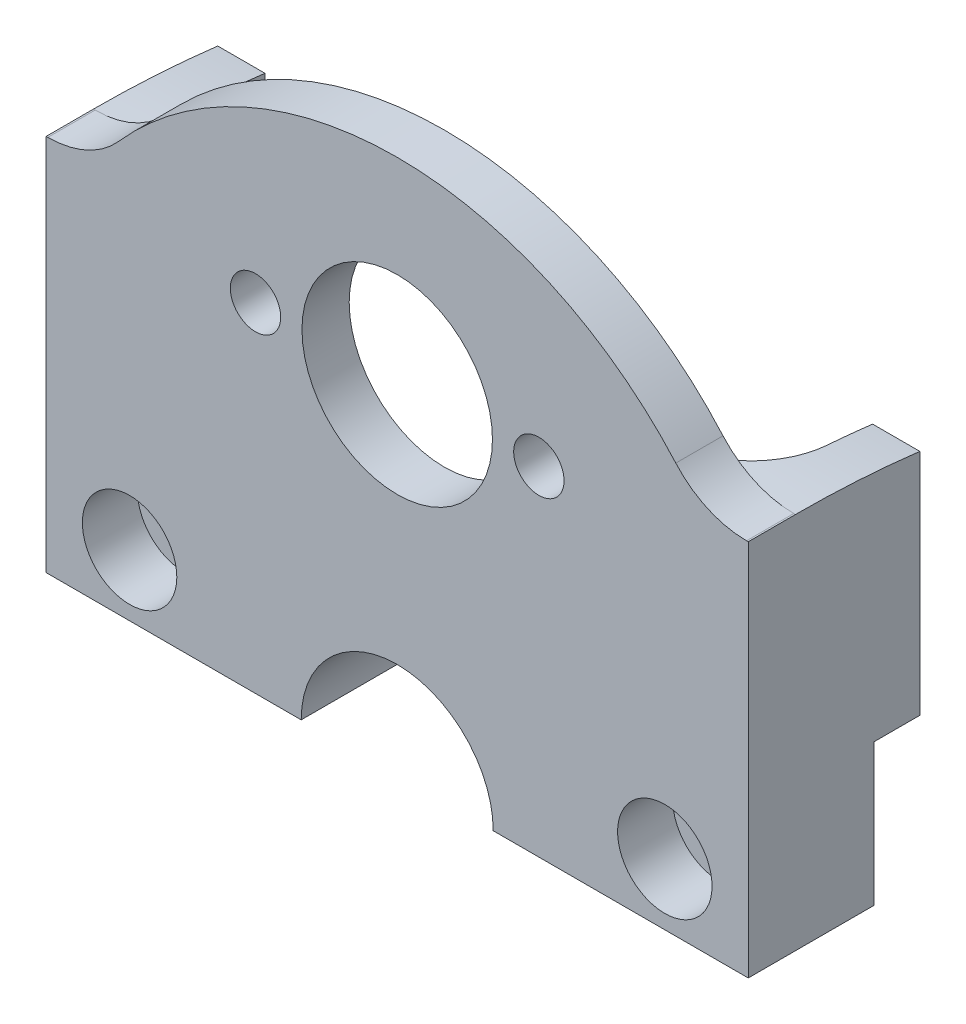
ISO-10303-21;
HEADER;
FILE_DESCRIPTION(('STEP AP214'),'2;1');
FILE_NAME('part.step','',(''),(''),'','','');
FILE_SCHEMA(('AUTOMOTIVE_DESIGN { 1 0 10303 214 1 1 1 1 }'));
ENDSEC;
DATA;
#1=APPLICATION_CONTEXT('core data for automotive mechanical design processes');
#2=APPLICATION_PROTOCOL_DEFINITION('international standard','automotive_design',2000,#1);
#3=PRODUCT_CONTEXT('',#1,'mechanical');
#4=PRODUCT('Part','Part','',(#3));
#5=PRODUCT_RELATED_PRODUCT_CATEGORY('part','',(#4));
#6=PRODUCT_DEFINITION_FORMATION('','',#4);
#7=PRODUCT_DEFINITION_CONTEXT('part definition',#1,'design');
#8=PRODUCT_DEFINITION('design','',#6,#7);
#9=PRODUCT_DEFINITION_SHAPE('','',#8);
#10=(LENGTH_UNIT() NAMED_UNIT(*) SI_UNIT(.MILLI.,.METRE.));
#11=(NAMED_UNIT(*) PLANE_ANGLE_UNIT() SI_UNIT($,.RADIAN.));
#12=(NAMED_UNIT(*) SI_UNIT($,.STERADIAN.) SOLID_ANGLE_UNIT());
#13=UNCERTAINTY_MEASURE_WITH_UNIT(LENGTH_MEASURE(1.E-05),#10,'distance_accuracy_value','');
#14=(GEOMETRIC_REPRESENTATION_CONTEXT(3) GLOBAL_UNCERTAINTY_ASSIGNED_CONTEXT((#13)) GLOBAL_UNIT_ASSIGNED_CONTEXT((#10,
#11,#12)) REPRESENTATION_CONTEXT('',''));
#15=CARTESIAN_POINT('',(0.,0.,0.));
#16=DIRECTION('',(0.,0.,1.));
#17=DIRECTION('',(1.,0.,0.));
#18=AXIS2_PLACEMENT_3D('',#15,#16,#17);
#19=CARTESIAN_POINT('',(-17.,18.8,-8.));
#20=DIRECTION('',(0.,0.,1.));
#21=DIRECTION('',(1.,0.,0.));
#22=AXIS2_PLACEMENT_3D('',#19,#20,#21);
#23=CYLINDRICAL_SURFACE('',#22,1.6);
#24=CARTESIAN_POINT('',(-17.,18.8,-8.));
#25=DIRECTION('',(0.,0.,1.));
#26=DIRECTION('',(1.,0.,0.));
#27=AXIS2_PLACEMENT_3D('',#24,#25,#26);
#28=CIRCLE('',#27,1.6);
#29=CARTESIAN_POINT('',(-15.4,18.8,-8.));
#30=VERTEX_POINT('',#29);
#31=EDGE_CURVE('E224',#30,#30,#28,.T.);
#32=ORIENTED_EDGE('',*,*,#31,.F.);
#33=EDGE_LOOP('',(#32));
#34=FACE_BOUND('',#33,.T.);
#35=CARTESIAN_POINT('',(-17.,18.8,-3.5));
#36=DIRECTION('',(0.,0.,1.));
#37=DIRECTION('',(1.,0.,0.));
#38=AXIS2_PLACEMENT_3D('',#35,#36,#37);
#39=CIRCLE('',#38,1.6);
#40=CARTESIAN_POINT('',(-15.4,18.8,-3.5));
#41=VERTEX_POINT('',#40);
#42=EDGE_CURVE('E199',#41,#41,#39,.F.);
#43=ORIENTED_EDGE('',*,*,#42,.F.);
#44=EDGE_LOOP('',(#43));
#45=FACE_BOUND('',#44,.T.);
#46=ADVANCED_FACE('F34',(#34,#45),#23,.F.);
#47=CARTESIAN_POINT('',(17.,18.8,-8.));
#48=DIRECTION('',(0.,0.,1.));
#49=DIRECTION('',(1.,0.,0.));
#50=AXIS2_PLACEMENT_3D('',#47,#48,#49);
#51=CYLINDRICAL_SURFACE('',#50,1.6);
#52=CARTESIAN_POINT('',(17.,18.8,-8.));
#53=DIRECTION('',(0.,0.,1.));
#54=DIRECTION('',(1.,0.,0.));
#55=AXIS2_PLACEMENT_3D('',#52,#53,#54);
#56=CIRCLE('',#55,1.6);
#57=CARTESIAN_POINT('',(18.6,18.8,-8.));
#58=VERTEX_POINT('',#57);
#59=EDGE_CURVE('E221',#58,#58,#56,.T.);
#60=ORIENTED_EDGE('',*,*,#59,.F.);
#61=EDGE_LOOP('',(#60));
#62=FACE_BOUND('',#61,.T.);
#63=CARTESIAN_POINT('',(17.,18.8,-3.5));
#64=DIRECTION('',(0.,0.,1.));
#65=DIRECTION('',(1.,0.,0.));
#66=AXIS2_PLACEMENT_3D('',#63,#64,#65);
#67=CIRCLE('',#66,1.6);
#68=CARTESIAN_POINT('',(18.6,18.8,-3.5));
#69=VERTEX_POINT('',#68);
#70=EDGE_CURVE('E203',#69,#69,#67,.F.);
#71=ORIENTED_EDGE('',*,*,#70,.F.);
#72=EDGE_LOOP('',(#71));
#73=FACE_BOUND('',#72,.T.);
#74=ADVANCED_FACE('F370',(#62,#73),#51,.F.);
#75=CARTESIAN_POINT('',(0.,25.2755,-3.));
#76=DIRECTION('',(0.,0.,1.));
#77=DIRECTION('',(1.,0.,0.));
#78=AXIS2_PLACEMENT_3D('',#75,#76,#77);
#79=CYLINDRICAL_SURFACE('',#78,23.6245);
#80=CARTESIAN_POINT('',(0.,25.2755,0.));
#81=DIRECTION('',(0.,0.,1.));
#82=DIRECTION('',(1.,0.,0.));
#83=AXIS2_PLACEMENT_3D('',#80,#81,#82);
#84=CIRCLE('',#83,23.6245);
#85=CARTESIAN_POINT('',(-17.6974341426189,40.9253506388293,0.));
#86=VERTEX_POINT('',#85);
#87=CARTESIAN_POINT('',(17.6974341426189,40.9253506388293,0.));
#88=VERTEX_POINT('',#87);
#89=EDGE_CURVE('E253',#86,#88,#84,.F.);
#90=ORIENTED_EDGE('',*,*,#89,.T.);
#91=DIRECTION('',(0.,0.,1.));
#92=VECTOR('',#91,1.);
#93=CARTESIAN_POINT('',(17.6974341426189,40.9253506388293,-3.));
#94=LINE('',#93,#92);
#95=CARTESIAN_POINT('',(17.6974341426189,40.9253506388293,-3.));
#96=VERTEX_POINT('',#95);
#97=EDGE_CURVE('E314',#88,#96,#94,.F.);
#98=ORIENTED_EDGE('',*,*,#97,.T.);
#99=CARTESIAN_POINT('',(0.,25.2755,-3.));
#100=DIRECTION('',(0.,0.,1.));
#101=DIRECTION('',(1.,0.,0.));
#102=AXIS2_PLACEMENT_3D('',#99,#100,#101);
#103=CIRCLE('',#102,23.6245);
#104=CARTESIAN_POINT('',(-17.6974341426189,40.9253506388293,-3.));
#105=VERTEX_POINT('',#104);
#106=EDGE_CURVE('E260',#105,#96,#103,.F.);
#107=ORIENTED_EDGE('',*,*,#106,.F.);
#108=DIRECTION('',(0.,0.,1.));
#109=VECTOR('',#108,1.);
#110=CARTESIAN_POINT('',(-17.6974341426189,40.9253506388293,-3.));
#111=LINE('',#110,#109);
#112=EDGE_CURVE('E311',#105,#86,#111,.T.);
#113=ORIENTED_EDGE('',*,*,#112,.T.);
#114=EDGE_LOOP('',(#90,#98,#107,#113));
#115=FACE_BOUND('',#114,.T.);
#116=ADVANCED_FACE('F366',(#115),#79,.T.);
#117=CARTESIAN_POINT('',(0.,38.9,-3.));
#118=DIRECTION('',(0.,-1.,0.));
#119=DIRECTION('',(0.,0.,-1.));
#120=AXIS2_PLACEMENT_3D('',#117,#118,#119);
#121=PLANE('',#120);
#122=DIRECTION('',(1.,0.,0.));
#123=VECTOR('',#122,1.);
#124=CARTESIAN_POINT('',(0.,38.9,-3.));
#125=LINE('',#124,#123);
#126=CARTESIAN_POINT('',(22.1921157170739,38.9,-3.));
#127=VERTEX_POINT('',#126);
#128=CARTESIAN_POINT('',(22.3,38.9,-3.));
#129=VERTEX_POINT('',#128);
#130=EDGE_CURVE('E270',#127,#129,#125,.T.);
#131=ORIENTED_EDGE('',*,*,#130,.F.);
#132=DIRECTION('',(0.,0.,-1.));
#133=VECTOR('',#132,1.);
#134=CARTESIAN_POINT('',(22.1921157170739,38.9,0.));
#135=LINE('',#134,#133);
#136=CARTESIAN_POINT('',(22.1921157170739,38.9,0.));
#137=VERTEX_POINT('',#136);
#138=EDGE_CURVE('E304',#127,#137,#135,.F.);
#139=ORIENTED_EDGE('',*,*,#138,.T.);
#140=DIRECTION('',(1.,0.,0.));
#141=VECTOR('',#140,1.);
#142=CARTESIAN_POINT('',(0.,38.9,0.));
#143=LINE('',#142,#141);
#144=CARTESIAN_POINT('',(22.3,38.9,0.));
#145=VERTEX_POINT('',#144);
#146=EDGE_CURVE('E291',#137,#145,#143,.T.);
#147=ORIENTED_EDGE('',*,*,#146,.T.);
#148=DIRECTION('',(0.,0.,1.));
#149=VECTOR('',#148,1.);
#150=CARTESIAN_POINT('',(22.3,38.9,-3.));
#151=LINE('',#150,#149);
#152=EDGE_CURVE('E301',#129,#145,#151,.T.);
#153=ORIENTED_EDGE('',*,*,#152,.F.);
#154=EDGE_LOOP('',(#131,#139,#147,#153));
#155=FACE_BOUND('',#154,.T.);
#156=ADVANCED_FACE('F369',(#155),#121,.F.);
#157=CARTESIAN_POINT('',(22.3,0.,-3.));
#158=DIRECTION('',(-1.,0.,0.));
#159=DIRECTION('',(0.,-1.,0.));
#160=AXIS2_PLACEMENT_3D('',#157,#158,#159);
#161=PLANE('',#160);
#162=DIRECTION('',(0.,0.,1.));
#163=VECTOR('',#162,1.);
#164=CARTESIAN_POINT('',(22.3,23.9,-8.));
#165=LINE('',#164,#163);
#166=CARTESIAN_POINT('',(22.3,23.9,-10.9));
#167=VERTEX_POINT('',#166);
#168=CARTESIAN_POINT('',(22.3,23.9,-8.));
#169=VERTEX_POINT('',#168);
#170=EDGE_CURVE('E187',#167,#169,#165,.T.);
#171=ORIENTED_EDGE('',*,*,#170,.F.);
#172=DIRECTION('',(0.,1.,0.));
#173=VECTOR('',#172,1.);
#174=CARTESIAN_POINT('',(22.3,67.2029660910765,-10.9));
#175=LINE('',#174,#173);
#176=CARTESIAN_POINT('',(22.3,38.4219895869804,-10.9));
#177=VERTEX_POINT('',#176);
#178=EDGE_CURVE('E169',#167,#177,#175,.T.);
#179=ORIENTED_EDGE('',*,*,#178,.T.);
#180=CARTESIAN_POINT('',(22.3,-26.6200098668084,-3.));
#181=DIRECTION('',(-1.,0.,0.));
#182=DIRECTION('',(0.,1.,0.));
#183=AXIS2_PLACEMENT_3D('',#180,#181,#182);
#184=CIRCLE('',#183,65.5200098668084);
#185=EDGE_CURVE('E198',#129,#177,#184,.T.);
#186=ORIENTED_EDGE('',*,*,#185,.F.);
#187=ORIENTED_EDGE('',*,*,#152,.T.);
#188=DIRECTION('',(0.,-1.,0.));
#189=VECTOR('',#188,1.);
#190=CARTESIAN_POINT('',(22.3,0.,0.));
#191=LINE('',#190,#189);
#192=CARTESIAN_POINT('',(22.3,14.9,0.));
#193=VERTEX_POINT('',#192);
#194=EDGE_CURVE('E289',#145,#193,#191,.T.);
#195=ORIENTED_EDGE('',*,*,#194,.T.);
#196=DIRECTION('',(0.,0.,1.));
#197=VECTOR('',#196,1.);
#198=CARTESIAN_POINT('',(22.3,14.9,-8.));
#199=LINE('',#198,#197);
#200=CARTESIAN_POINT('',(22.3,14.9,-8.));
#201=VERTEX_POINT('',#200);
#202=EDGE_CURVE('E254',#201,#193,#199,.T.);
#203=ORIENTED_EDGE('',*,*,#202,.F.);
#204=DIRECTION('',(0.,1.,0.));
#205=VECTOR('',#204,1.);
#206=CARTESIAN_POINT('',(22.3,0.,-8.));
#207=LINE('',#206,#205);
#208=EDGE_CURVE('E197',#201,#169,#207,.T.);
#209=ORIENTED_EDGE('',*,*,#208,.T.);
#210=EDGE_LOOP('',(#171,#179,#186,#187,#195,#203,#209));
#211=FACE_BOUND('',#210,.T.);
#212=ADVANCED_FACE('F195',(#211),#161,.F.);
#213=CARTESIAN_POINT('',(-22.3,0.,-3.));
#214=DIRECTION('',(-1.,0.,0.));
#215=DIRECTION('',(0.,-1.,0.));
#216=AXIS2_PLACEMENT_3D('',#213,#214,#215);
#217=PLANE('',#216);
#218=DIRECTION('',(0.,1.,0.));
#219=VECTOR('',#218,1.);
#220=CARTESIAN_POINT('',(-22.3,67.2029660910765,-10.9));
#221=LINE('',#220,#219);
#222=CARTESIAN_POINT('',(-22.3,23.9,-10.9));
#223=VERTEX_POINT('',#222);
#224=CARTESIAN_POINT('',(-22.3,38.4219895869804,-10.9));
#225=VERTEX_POINT('',#224);
#226=EDGE_CURVE('E181',#223,#225,#221,.T.);
#227=ORIENTED_EDGE('',*,*,#226,.F.);
#228=DIRECTION('',(0.,0.,1.));
#229=VECTOR('',#228,1.);
#230=CARTESIAN_POINT('',(-22.3,23.9,-8.));
#231=LINE('',#230,#229);
#232=CARTESIAN_POINT('',(-22.3,23.9,-8.));
#233=VERTEX_POINT('',#232);
#234=EDGE_CURVE('E212',#223,#233,#231,.T.);
#235=ORIENTED_EDGE('',*,*,#234,.T.);
#236=DIRECTION('',(0.,-1.,0.));
#237=VECTOR('',#236,1.);
#238=CARTESIAN_POINT('',(-22.3,0.,-8.));
#239=LINE('',#238,#237);
#240=CARTESIAN_POINT('',(-22.3,14.9,-8.));
#241=VERTEX_POINT('',#240);
#242=EDGE_CURVE('E240',#233,#241,#239,.T.);
#243=ORIENTED_EDGE('',*,*,#242,.T.);
#244=DIRECTION('',(0.,0.,1.));
#245=VECTOR('',#244,1.);
#246=CARTESIAN_POINT('',(-22.3,14.9,-8.));
#247=LINE('',#246,#245);
#248=CARTESIAN_POINT('',(-22.3,14.9,0.));
#249=VERTEX_POINT('',#248);
#250=EDGE_CURVE('E250',#241,#249,#247,.T.);
#251=ORIENTED_EDGE('',*,*,#250,.T.);
#252=DIRECTION('',(0.,-1.,0.));
#253=VECTOR('',#252,1.);
#254=CARTESIAN_POINT('',(-22.3,0.,0.));
#255=LINE('',#254,#253);
#256=CARTESIAN_POINT('',(-22.3,38.9,0.));
#257=VERTEX_POINT('',#256);
#258=EDGE_CURVE('E287',#257,#249,#255,.T.);
#259=ORIENTED_EDGE('',*,*,#258,.F.);
#260=DIRECTION('',(0.,0.,1.));
#261=VECTOR('',#260,1.);
#262=CARTESIAN_POINT('',(-22.3,38.9,-3.));
#263=LINE('',#262,#261);
#264=CARTESIAN_POINT('',(-22.3,38.9,-3.));
#265=VERTEX_POINT('',#264);
#266=EDGE_CURVE('E281',#265,#257,#263,.T.);
#267=ORIENTED_EDGE('',*,*,#266,.F.);
#268=CARTESIAN_POINT('',(-22.3,-26.6200098668084,-3.));
#269=DIRECTION('',(-1.,0.,0.));
#270=DIRECTION('',(0.,1.,0.));
#271=AXIS2_PLACEMENT_3D('',#268,#269,#270);
#272=CIRCLE('',#271,65.5200098668084);
#273=EDGE_CURVE('E191',#265,#225,#272,.T.);
#274=ORIENTED_EDGE('',*,*,#273,.T.);
#275=EDGE_LOOP('',(#227,#235,#243,#251,#259,#267,#274));
#276=FACE_BOUND('',#275,.T.);
#277=ADVANCED_FACE('F378',(#276),#217,.T.);
#278=CARTESIAN_POINT('',(-8.99999999999999,36.4,-3.));
#279=DIRECTION('',(0.,0.,1.));
#280=DIRECTION('',(1.,0.,0.));
#281=AXIS2_PLACEMENT_3D('',#278,#279,#280);
#282=CYLINDRICAL_SURFACE('',#281,1.59999999999999);
#283=CARTESIAN_POINT('',(-8.99999999999999,36.4,-3.));
#284=DIRECTION('',(0.,0.,1.));
#285=DIRECTION('',(1.,0.,0.));
#286=AXIS2_PLACEMENT_3D('',#283,#284,#285);
#287=CIRCLE('',#286,1.59999999999999);
#288=CARTESIAN_POINT('',(-7.4,36.4,-3.));
#289=VERTEX_POINT('',#288);
#290=EDGE_CURVE('E275',#289,#289,#287,.T.);
#291=ORIENTED_EDGE('',*,*,#290,.F.);
#292=EDGE_LOOP('',(#291));
#293=FACE_BOUND('',#292,.T.);
#294=CARTESIAN_POINT('',(-8.99999999999999,36.4,0.));
#295=DIRECTION('',(0.,0.,1.));
#296=DIRECTION('',(1.,0.,0.));
#297=AXIS2_PLACEMENT_3D('',#294,#295,#296);
#298=CIRCLE('',#297,1.59999999999999);
#299=CARTESIAN_POINT('',(-7.4,36.4,0.));
#300=VERTEX_POINT('',#299);
#301=EDGE_CURVE('E296',#300,#300,#298,.T.);
#302=ORIENTED_EDGE('',*,*,#301,.T.);
#303=EDGE_LOOP('',(#302));
#304=FACE_BOUND('',#303,.T.);
#305=ADVANCED_FACE('F381',(#293,#304),#282,.F.);
#306=CARTESIAN_POINT('',(8.99999999999999,36.4,-3.));
#307=DIRECTION('',(0.,0.,1.));
#308=DIRECTION('',(1.,0.,0.));
#309=AXIS2_PLACEMENT_3D('',#306,#307,#308);
#310=CYLINDRICAL_SURFACE('',#309,1.60000000000001);
#311=CARTESIAN_POINT('',(8.99999999999999,36.4,-3.));
#312=DIRECTION('',(0.,0.,1.));
#313=DIRECTION('',(1.,0.,0.));
#314=AXIS2_PLACEMENT_3D('',#311,#312,#313);
#315=CIRCLE('',#314,1.60000000000001);
#316=CARTESIAN_POINT('',(10.6,36.4,-3.));
#317=VERTEX_POINT('',#316);
#318=EDGE_CURVE('E272',#317,#317,#315,.T.);
#319=ORIENTED_EDGE('',*,*,#318,.F.);
#320=EDGE_LOOP('',(#319));
#321=FACE_BOUND('',#320,.T.);
#322=CARTESIAN_POINT('',(8.99999999999999,36.4,0.));
#323=DIRECTION('',(0.,0.,1.));
#324=DIRECTION('',(1.,0.,0.));
#325=AXIS2_PLACEMENT_3D('',#322,#323,#324);
#326=CIRCLE('',#325,1.60000000000001);
#327=CARTESIAN_POINT('',(10.6,36.4,0.));
#328=VERTEX_POINT('',#327);
#329=EDGE_CURVE('E293',#328,#328,#326,.T.);
#330=ORIENTED_EDGE('',*,*,#329,.T.);
#331=EDGE_LOOP('',(#330));
#332=FACE_BOUND('',#331,.T.);
#333=ADVANCED_FACE('F376',(#321,#332),#310,.F.);
#334=CARTESIAN_POINT('',(0.,38.9,-3.));
#335=DIRECTION('',(0.,-1.,0.));
#336=DIRECTION('',(0.,0.,-1.));
#337=AXIS2_PLACEMENT_3D('',#334,#335,#336);
#338=PLANE('',#337);
#339=DIRECTION('',(1.,0.,0.));
#340=VECTOR('',#339,1.);
#341=CARTESIAN_POINT('',(0.,38.9,0.));
#342=LINE('',#341,#340);
#343=CARTESIAN_POINT('',(-22.1921157170739,38.9,0.));
#344=VERTEX_POINT('',#343);
#345=EDGE_CURVE('E284',#257,#344,#342,.T.);
#346=ORIENTED_EDGE('',*,*,#345,.T.);
#347=DIRECTION('',(0.,0.,-1.));
#348=VECTOR('',#347,1.);
#349=CARTESIAN_POINT('',(-22.1921157170739,38.9,-3.));
#350=LINE('',#349,#348);
#351=CARTESIAN_POINT('',(-22.1921107704198,38.9,-3.));
#352=VERTEX_POINT('',#351);
#353=EDGE_CURVE('E316',#344,#352,#350,.T.);
#354=ORIENTED_EDGE('',*,*,#353,.T.);
#355=DIRECTION('',(1.,0.,0.));
#356=VECTOR('',#355,1.);
#357=CARTESIAN_POINT('',(0.,38.9,-3.));
#358=LINE('',#357,#356);
#359=EDGE_CURVE('E263',#265,#352,#358,.T.);
#360=ORIENTED_EDGE('',*,*,#359,.F.);
#361=ORIENTED_EDGE('',*,*,#266,.T.);
#362=EDGE_LOOP('',(#346,#354,#360,#361));
#363=FACE_BOUND('',#362,.T.);
#364=ADVANCED_FACE('F372',(#363),#338,.F.);
#365=CARTESIAN_POINT('',(0.,36.4,-3.));
#366=DIRECTION('',(0.,0.,1.));
#367=DIRECTION('',(1.,0.,0.));
#368=AXIS2_PLACEMENT_3D('',#365,#366,#367);
#369=CYLINDRICAL_SURFACE('',#368,6.05);
#370=CARTESIAN_POINT('',(0.,36.4,-3.));
#371=DIRECTION('',(0.,0.,1.));
#372=DIRECTION('',(1.,0.,0.));
#373=AXIS2_PLACEMENT_3D('',#370,#371,#372);
#374=CIRCLE('',#373,6.05);
#375=CARTESIAN_POINT('',(6.05,36.4,-3.));
#376=VERTEX_POINT('',#375);
#377=EDGE_CURVE('E278',#376,#376,#374,.T.);
#378=ORIENTED_EDGE('',*,*,#377,.F.);
#379=EDGE_LOOP('',(#378));
#380=FACE_BOUND('',#379,.T.);
#381=CARTESIAN_POINT('',(0.,36.4,0.));
#382=DIRECTION('',(0.,0.,1.));
#383=DIRECTION('',(1.,0.,0.));
#384=AXIS2_PLACEMENT_3D('',#381,#382,#383);
#385=CIRCLE('',#384,6.05);
#386=CARTESIAN_POINT('',(6.05,36.4,0.));
#387=VERTEX_POINT('',#386);
#388=EDGE_CURVE('E264',#387,#387,#385,.T.);
#389=ORIENTED_EDGE('',*,*,#388,.T.);
#390=EDGE_LOOP('',(#389));
#391=FACE_BOUND('',#390,.T.);
#392=ADVANCED_FACE('F375',(#380,#391),#369,.F.);
#393=CARTESIAN_POINT('',(0.,0.,-3.));
#394=DIRECTION('',(0.,0.,1.));
#395=DIRECTION('',(1.,0.,0.));
#396=AXIS2_PLACEMENT_3D('',#393,#394,#395);
#397=PLANE('',#396);
#398=DIRECTION('',(1.,0.,0.));
#399=VECTOR('',#398,1.);
#400=CARTESIAN_POINT('',(19.3,38.9,-3.));
#401=LINE('',#400,#399);
#402=CARTESIAN_POINT('',(14.3,38.9,-3.));
#403=VERTEX_POINT('',#402);
#404=EDGE_CURVE('E61',#403,#127,#401,.T.);
#405=ORIENTED_EDGE('',*,*,#404,.F.);
#406=DIRECTION('',(0.,1.,0.));
#407=VECTOR('',#406,1.);
#408=CARTESIAN_POINT('',(14.3,0.,-3.));
#409=LINE('',#408,#407);
#410=CARTESIAN_POINT('',(14.3,23.9,-3.));
#411=VERTEX_POINT('',#410);
#412=EDGE_CURVE('E336',#403,#411,#409,.F.);
#413=ORIENTED_EDGE('',*,*,#412,.T.);
#414=DIRECTION('',(1.,0.,0.));
#415=VECTOR('',#414,1.);
#416=CARTESIAN_POINT('',(0.,23.9,-3.));
#417=LINE('',#416,#415);
#418=CARTESIAN_POINT('',(-14.3,23.9,-3.));
#419=VERTEX_POINT('',#418);
#420=EDGE_CURVE('E267',#419,#411,#417,.T.);
#421=ORIENTED_EDGE('',*,*,#420,.F.);
#422=DIRECTION('',(0.,1.,0.));
#423=VECTOR('',#422,1.);
#424=CARTESIAN_POINT('',(-14.3,0.,-3.));
#425=LINE('',#424,#423);
#426=CARTESIAN_POINT('',(-14.3,38.9,-3.));
#427=VERTEX_POINT('',#426);
#428=EDGE_CURVE('E333',#419,#427,#425,.T.);
#429=ORIENTED_EDGE('',*,*,#428,.T.);
#430=DIRECTION('',(-1.,0.,0.));
#431=VECTOR('',#430,1.);
#432=CARTESIAN_POINT('',(-19.3,38.9,-3.));
#433=LINE('',#432,#431);
#434=EDGE_CURVE('E328',#427,#352,#433,.T.);
#435=ORIENTED_EDGE('',*,*,#434,.T.);
#436=CARTESIAN_POINT('',(-22.1921157170739,44.9,-3.));
#437=DIRECTION('',(0.,0.,1.));
#438=DIRECTION('',(1.,0.,0.));
#439=AXIS2_PLACEMENT_3D('',#436,#437,#438);
#440=CIRCLE('',#439,6.);
#441=EDGE_CURVE('E325',#352,#105,#440,.T.);
#442=ORIENTED_EDGE('',*,*,#441,.T.);
#443=ORIENTED_EDGE('',*,*,#106,.T.);
#444=CARTESIAN_POINT('',(22.1921157170739,44.9,-3.));
#445=DIRECTION('',(0.,0.,1.));
#446=DIRECTION('',(1.,0.,0.));
#447=AXIS2_PLACEMENT_3D('',#444,#445,#446);
#448=CIRCLE('',#447,6.);
#449=EDGE_CURVE('E321',#96,#127,#448,.T.);
#450=ORIENTED_EDGE('',*,*,#449,.T.);
#451=EDGE_LOOP('',(#405,#413,#421,#429,#435,#442,#443,#450));
#452=FACE_BOUND('',#451,.T.);
#453=ORIENTED_EDGE('',*,*,#318,.T.);
#454=EDGE_LOOP('',(#453));
#455=FACE_BOUND('',#454,.T.);
#456=ORIENTED_EDGE('',*,*,#290,.T.);
#457=EDGE_LOOP('',(#456));
#458=FACE_BOUND('',#457,.T.);
#459=ORIENTED_EDGE('',*,*,#377,.T.);
#460=EDGE_LOOP('',(#459));
#461=FACE_BOUND('',#460,.T.);
#462=ADVANCED_FACE('F396',(#452,#455,#458,#461),#397,.F.);
#463=CARTESIAN_POINT('',(0.,0.,0.));
#464=DIRECTION('',(0.,0.,1.));
#465=DIRECTION('',(1.,0.,0.));
#466=AXIS2_PLACEMENT_3D('',#463,#464,#465);
#467=PLANE('',#466);
#468=CARTESIAN_POINT('',(-17.,18.8,0.));
#469=DIRECTION('',(0.,0.,1.));
#470=DIRECTION('',(1.,0.,0.));
#471=AXIS2_PLACEMENT_3D('',#468,#469,#470);
#472=CIRCLE('',#471,3.);
#473=CARTESIAN_POINT('',(-14.,18.8,0.));
#474=VERTEX_POINT('',#473);
#475=EDGE_CURVE('E505',#474,#474,#472,.T.);
#476=ORIENTED_EDGE('',*,*,#475,.F.);
#477=EDGE_LOOP('',(#476));
#478=FACE_BOUND('',#477,.T.);
#479=CARTESIAN_POINT('',(17.,18.8,0.));
#480=DIRECTION('',(0.,0.,1.));
#481=DIRECTION('',(1.,0.,0.));
#482=AXIS2_PLACEMENT_3D('',#479,#480,#481);
#483=CIRCLE('',#482,3.);
#484=CARTESIAN_POINT('',(20.,18.8,0.));
#485=VERTEX_POINT('',#484);
#486=EDGE_CURVE('E498',#485,#485,#483,.T.);
#487=ORIENTED_EDGE('',*,*,#486,.F.);
#488=EDGE_LOOP('',(#487));
#489=FACE_BOUND('',#488,.T.);
#490=ORIENTED_EDGE('',*,*,#89,.F.);
#491=CARTESIAN_POINT('',(-22.1921157170739,44.9,0.));
#492=DIRECTION('',(0.,0.,1.));
#493=DIRECTION('',(1.,0.,0.));
#494=AXIS2_PLACEMENT_3D('',#491,#492,#493);
#495=CIRCLE('',#494,6.);
#496=EDGE_CURVE('E323',#86,#344,#495,.F.);
#497=ORIENTED_EDGE('',*,*,#496,.T.);
#498=ORIENTED_EDGE('',*,*,#345,.F.);
#499=ORIENTED_EDGE('',*,*,#258,.T.);
#500=DIRECTION('',(1.,0.,0.));
#501=VECTOR('',#500,1.);
#502=CARTESIAN_POINT('',(0.,14.9,0.));
#503=LINE('',#502,#501);
#504=CARTESIAN_POINT('',(-6.10000000000001,14.9,0.));
#505=VERTEX_POINT('',#504);
#506=EDGE_CURVE('E220',#249,#505,#503,.T.);
#507=ORIENTED_EDGE('',*,*,#506,.T.);
#508=CARTESIAN_POINT('',(0.,14.9,0.));
#509=DIRECTION('',(0.,0.,1.));
#510=DIRECTION('',(1.,0.,0.));
#511=AXIS2_PLACEMENT_3D('',#508,#509,#510);
#512=CIRCLE('',#511,6.10000000000001);
#513=CARTESIAN_POINT('',(6.10000000000001,14.9,0.));
#514=VERTEX_POINT('',#513);
#515=EDGE_CURVE('E247',#505,#514,#512,.F.);
#516=ORIENTED_EDGE('',*,*,#515,.T.);
#517=EDGE_CURVE('E225',#514,#193,#503,.T.);
#518=ORIENTED_EDGE('',*,*,#517,.T.);
#519=ORIENTED_EDGE('',*,*,#194,.F.);
#520=ORIENTED_EDGE('',*,*,#146,.F.);
#521=CARTESIAN_POINT('',(22.1921157170739,44.9,0.));
#522=DIRECTION('',(0.,0.,1.));
#523=DIRECTION('',(1.,0.,0.));
#524=AXIS2_PLACEMENT_3D('',#521,#522,#523);
#525=CIRCLE('',#524,6.);
#526=EDGE_CURVE('E319',#137,#88,#525,.F.);
#527=ORIENTED_EDGE('',*,*,#526,.T.);
#528=EDGE_LOOP('',(#490,#497,#498,#499,#507,#516,#518,#519,#520,#527));
#529=FACE_BOUND('',#528,.T.);
#530=ORIENTED_EDGE('',*,*,#329,.F.);
#531=EDGE_LOOP('',(#530));
#532=FACE_BOUND('',#531,.T.);
#533=ORIENTED_EDGE('',*,*,#301,.F.);
#534=EDGE_LOOP('',(#533));
#535=FACE_BOUND('',#534,.T.);
#536=ORIENTED_EDGE('',*,*,#388,.F.);
#537=EDGE_LOOP('',(#536));
#538=FACE_BOUND('',#537,.T.);
#539=ADVANCED_FACE('F398',(#478,#489,#529,#532,#535,#538),#467,.T.);
#540=CARTESIAN_POINT('',(0.,23.9,-8.));
#541=DIRECTION('',(0.,-1.,0.));
#542=DIRECTION('',(0.,0.,-1.));
#543=AXIS2_PLACEMENT_3D('',#540,#541,#542);
#544=PLANE('',#543);
#545=ORIENTED_EDGE('',*,*,#420,.T.);
#546=CARTESIAN_POINT('',(14.3,23.9,-8.));
#547=DIRECTION('',(0.,-1.,0.));
#548=DIRECTION('',(0.,0.,-1.));
#549=AXIS2_PLACEMENT_3D('',#546,#547,#548);
#550=CIRCLE('',#549,5.);
#551=CARTESIAN_POINT('',(19.3,23.9,-8.));
#552=VERTEX_POINT('',#551);
#553=EDGE_CURVE('E340',#411,#552,#550,.F.);
#554=ORIENTED_EDGE('',*,*,#553,.T.);
#555=DIRECTION('',(1.,0.,0.));
#556=VECTOR('',#555,1.);
#557=CARTESIAN_POINT('',(0.,23.9,-8.));
#558=LINE('',#557,#556);
#559=CARTESIAN_POINT('',(-19.3,23.9,-8.));
#560=VERTEX_POINT('',#559);
#561=EDGE_CURVE('E241',#560,#552,#558,.T.);
#562=ORIENTED_EDGE('',*,*,#561,.F.);
#563=CARTESIAN_POINT('',(-14.3,23.9,-8.));
#564=DIRECTION('',(0.,-1.,0.));
#565=DIRECTION('',(0.,0.,-1.));
#566=AXIS2_PLACEMENT_3D('',#563,#564,#565);
#567=CIRCLE('',#566,5.);
#568=EDGE_CURVE('E338',#560,#419,#567,.F.);
#569=ORIENTED_EDGE('',*,*,#568,.T.);
#570=EDGE_LOOP('',(#545,#554,#562,#569));
#571=FACE_BOUND('',#570,.T.);
#572=ADVANCED_FACE('F401',(#571),#544,.F.);
#573=CARTESIAN_POINT('',(0.,14.9,-8.));
#574=DIRECTION('',(0.,-1.,0.));
#575=DIRECTION('',(0.,0.,-1.));
#576=AXIS2_PLACEMENT_3D('',#573,#574,#575);
#577=PLANE('',#576);
#578=ORIENTED_EDGE('',*,*,#506,.F.);
#579=ORIENTED_EDGE('',*,*,#250,.F.);
#580=DIRECTION('',(1.,0.,0.));
#581=VECTOR('',#580,1.);
#582=CARTESIAN_POINT('',(0.,14.9,-8.));
#583=LINE('',#582,#581);
#584=CARTESIAN_POINT('',(-6.10000000000001,14.9,-8.));
#585=VERTEX_POINT('',#584);
#586=EDGE_CURVE('E228',#241,#585,#583,.T.);
#587=ORIENTED_EDGE('',*,*,#586,.T.);
#588=DIRECTION('',(0.,0.,1.));
#589=VECTOR('',#588,1.);
#590=CARTESIAN_POINT('',(-6.10000000000001,14.9,-8.));
#591=LINE('',#590,#589);
#592=EDGE_CURVE('E244',#585,#505,#591,.T.);
#593=ORIENTED_EDGE('',*,*,#592,.T.);
#594=EDGE_LOOP('',(#578,#579,#587,#593));
#595=FACE_BOUND('',#594,.T.);
#596=ADVANCED_FACE('F419',(#595),#577,.T.);
#597=ORIENTED_EDGE('',*,*,#517,.F.);
#598=DIRECTION('',(0.,0.,1.));
#599=VECTOR('',#598,1.);
#600=CARTESIAN_POINT('',(6.10000000000001,14.9,-8.));
#601=LINE('',#600,#599);
#602=CARTESIAN_POINT('',(6.10000000000001,14.9,-8.));
#603=VERTEX_POINT('',#602);
#604=EDGE_CURVE('E257',#603,#514,#601,.T.);
#605=ORIENTED_EDGE('',*,*,#604,.F.);
#606=EDGE_CURVE('E232',#603,#201,#583,.T.);
#607=ORIENTED_EDGE('',*,*,#606,.T.);
#608=ORIENTED_EDGE('',*,*,#202,.T.);
#609=EDGE_LOOP('',(#597,#605,#607,#608));
#610=FACE_BOUND('',#609,.T.);
#611=ADVANCED_FACE('F415',(#610),#577,.T.);
#612=CARTESIAN_POINT('',(0.,14.9,-8.));
#613=DIRECTION('',(0.,0.,1.));
#614=DIRECTION('',(1.,0.,0.));
#615=AXIS2_PLACEMENT_3D('',#612,#613,#614);
#616=CYLINDRICAL_SURFACE('',#615,6.10000000000001);
#617=ORIENTED_EDGE('',*,*,#515,.F.);
#618=ORIENTED_EDGE('',*,*,#592,.F.);
#619=CARTESIAN_POINT('',(0.,14.9,-8.));
#620=DIRECTION('',(0.,0.,1.));
#621=DIRECTION('',(1.,0.,0.));
#622=AXIS2_PLACEMENT_3D('',#619,#620,#621);
#623=CIRCLE('',#622,6.10000000000001);
#624=EDGE_CURVE('E231',#585,#603,#623,.F.);
#625=ORIENTED_EDGE('',*,*,#624,.T.);
#626=ORIENTED_EDGE('',*,*,#604,.T.);
#627=EDGE_LOOP('',(#617,#618,#625,#626));
#628=FACE_BOUND('',#627,.T.);
#629=ADVANCED_FACE('F411',(#628),#616,.F.);
#630=CARTESIAN_POINT('',(0.,0.,-8.));
#631=DIRECTION('',(0.,0.,1.));
#632=DIRECTION('',(1.,0.,0.));
#633=AXIS2_PLACEMENT_3D('',#630,#631,#632);
#634=PLANE('',#633);
#635=ORIENTED_EDGE('',*,*,#59,.T.);
#636=EDGE_LOOP('',(#635));
#637=FACE_BOUND('',#636,.T.);
#638=ORIENTED_EDGE('',*,*,#31,.T.);
#639=EDGE_LOOP('',(#638));
#640=FACE_BOUND('',#639,.T.);
#641=ORIENTED_EDGE('',*,*,#586,.F.);
#642=ORIENTED_EDGE('',*,*,#242,.F.);
#643=EDGE_CURVE('E237',#233,#560,#558,.T.);
#644=ORIENTED_EDGE('',*,*,#643,.T.);
#645=ORIENTED_EDGE('',*,*,#561,.T.);
#646=EDGE_CURVE('E236',#552,#169,#558,.T.);
#647=ORIENTED_EDGE('',*,*,#646,.T.);
#648=ORIENTED_EDGE('',*,*,#208,.F.);
#649=ORIENTED_EDGE('',*,*,#606,.F.);
#650=ORIENTED_EDGE('',*,*,#624,.F.);
#651=EDGE_LOOP('',(#641,#642,#644,#645,#647,#648,#649,#650));
#652=FACE_BOUND('',#651,.T.);
#653=ADVANCED_FACE('F414',(#637,#640,#652),#634,.F.);
#654=CARTESIAN_POINT('',(-19.3,23.9,-8.));
#655=DIRECTION('',(0.,-1.,0.));
#656=DIRECTION('',(1.,0.,0.));
#657=AXIS2_PLACEMENT_3D('',#654,#655,#656);
#658=PLANE('',#657);
#659=ORIENTED_EDGE('',*,*,#643,.F.);
#660=ORIENTED_EDGE('',*,*,#234,.F.);
#661=DIRECTION('',(-1.,0.,0.));
#662=VECTOR('',#661,1.);
#663=CARTESIAN_POINT('',(-19.3,23.9,-10.9));
#664=LINE('',#663,#662);
#665=CARTESIAN_POINT('',(-19.3,23.9,-10.9));
#666=VERTEX_POINT('',#665);
#667=EDGE_CURVE('E214',#666,#223,#664,.T.);
#668=ORIENTED_EDGE('',*,*,#667,.F.);
#669=DIRECTION('',(0.,0.,1.));
#670=VECTOR('',#669,1.);
#671=CARTESIAN_POINT('',(-19.3,23.9,-8.));
#672=LINE('',#671,#670);
#673=EDGE_CURVE('E208',#666,#560,#672,.T.);
#674=ORIENTED_EDGE('',*,*,#673,.T.);
#675=EDGE_LOOP('',(#659,#660,#668,#674));
#676=FACE_BOUND('',#675,.T.);
#677=ADVANCED_FACE('F425',(#676),#658,.T.);
#678=CARTESIAN_POINT('',(-19.3,-26.6200098668084,-3.));
#679=DIRECTION('',(-1.,0.,0.));
#680=DIRECTION('',(0.,-1.,0.));
#681=AXIS2_PLACEMENT_3D('',#678,#679,#680);
#682=CYLINDRICAL_SURFACE('',#681,65.5200098668084);
#683=DIRECTION('',(-1.,0.,0.));
#684=VECTOR('',#683,1.);
#685=CARTESIAN_POINT('',(-19.3,38.4219895869804,-10.9));
#686=LINE('',#685,#684);
#687=CARTESIAN_POINT('',(-19.3,38.4219895869804,-10.9));
#688=VERTEX_POINT('',#687);
#689=EDGE_CURVE('E502',#225,#688,#686,.F.);
#690=ORIENTED_EDGE('',*,*,#689,.F.);
#691=ORIENTED_EDGE('',*,*,#273,.F.);
#692=ORIENTED_EDGE('',*,*,#359,.T.);
#693=ORIENTED_EDGE('',*,*,#434,.F.);
#694=CARTESIAN_POINT('',(-14.3,38.9,-3.));
#695=CARTESIAN_POINT('',(-14.4406221789645,38.8999965896963,-2.99998488115081));
#696=CARTESIAN_POINT('',(-14.5812421885463,38.8999998929067,-3.00593174457794));
#697=CARTESIAN_POINT('',(-14.8614762537626,38.8999952790469,-3.02964024218829));
#698=CARTESIAN_POINT('',(-15.0010903570822,38.8999873625122,-3.04740131254229));
#699=CARTESIAN_POINT('',(-15.2782212876633,38.8999356854982,-3.09461144894922));
#700=CARTESIAN_POINT('',(-15.4157396005659,38.8998919517397,-3.12405179349617));
#701=CARTESIAN_POINT('',(-15.6878072374434,38.8997210835907,-3.19440632362345));
#702=CARTESIAN_POINT('',(-15.8223565976525,38.8995939502187,-3.23532036909059));
#703=CARTESIAN_POINT('',(-16.0875726717036,38.8991937381092,-3.32834728014036));
#704=CARTESIAN_POINT('',(-16.2182381851371,38.8989206147347,-3.38046356794208));
#705=CARTESIAN_POINT('',(-16.4747620671536,38.8981513211056,-3.49553791510958));
#706=CARTESIAN_POINT('',(-16.6006186407014,38.8976550684292,-3.5584999754994));
#707=CARTESIAN_POINT('',(-16.8465108518654,38.8963516691787,-3.69476716656762));
#708=CARTESIAN_POINT('',(-16.9665496161799,38.8955446917328,-3.76806665682855));
#709=CARTESIAN_POINT('',(-17.2000686473803,38.8935233750186,-3.92454138718328));
#710=CARTESIAN_POINT('',(-17.3135464835128,38.892308885891,-4.00772025306022));
#711=CARTESIAN_POINT('',(-17.5330191555438,38.8893729151611,-4.18328379838179));
#712=CARTESIAN_POINT('',(-17.639018608617,38.8876517498388,-4.27566271119587));
#713=CARTESIAN_POINT('',(-17.8428961604772,38.8836003404023,-4.46904617723465));
#714=CARTESIAN_POINT('',(-17.9407712193351,38.8812698696439,-4.57005393070938));
#715=CARTESIAN_POINT('',(-18.1276412434085,38.8759028499514,-4.77992236353782));
#716=CARTESIAN_POINT('',(-18.2166379057408,38.8728664363301,-4.88878153520191));
#717=CARTESIAN_POINT('',(-18.3851699078446,38.8659956262257,-5.11362963952823));
#718=CARTESIAN_POINT('',(-18.4647018740101,38.8621609465388,-5.22962109221752));
#719=CARTESIAN_POINT('',(-18.6136278275962,38.8536192022279,-5.46774508182911));
#720=CARTESIAN_POINT('',(-18.6830320193888,38.8489130266953,-5.58987126844435));
#721=CARTESIAN_POINT('',(-18.8113095455598,38.8385614808442,-5.8394955012428));
#722=CARTESIAN_POINT('',(-18.8701828346056,38.8329161064829,-5.96699357054752));
#723=CARTESIAN_POINT('',(-18.9769632727352,38.820641952261,-6.22639522291615));
#724=CARTESIAN_POINT('',(-19.0248752793208,38.8140136101583,-6.35829682473879));
#725=CARTESIAN_POINT('',(-19.1094250757755,38.7997495930237,-6.62556048398853));
#726=CARTESIAN_POINT('',(-19.1460652666401,38.7921141330125,-6.76092179780405));
#727=CARTESIAN_POINT('',(-19.2178485193973,38.7731867560275,-7.07851661023592));
#728=CARTESIAN_POINT('',(-19.2486645318693,38.7615114641014,-7.26173406197731));
#729=CARTESIAN_POINT('',(-19.2794682878651,38.742725711216,-7.53795471842154));
#730=CARTESIAN_POINT('',(-19.2871661609599,38.7362552947406,-7.63021310479708));
#731=CARTESIAN_POINT('',(-19.2974313553801,38.7229029672892,-7.81497842573819));
#732=CARTESIAN_POINT('',(-19.299999053385,38.7160210865629,-7.9074853415562));
#733=CARTESIAN_POINT('',(-19.3,38.7089400171953,-8.));
#734=B_SPLINE_CURVE_WITH_KNOTS('',3,(#694,#695,#696,#697,#698,#699,#700,#701,#702,#703,#704,
#705,#706,#707,#708,#709,#710,#711,#712,#713,#714,#715,#716,#717,#718,#719,#720,#721,#722,#723,
#724,#725,#726,#727,#728,#729,#730,#731,#732,#733),.UNSPECIFIED.,.F.,.F.,(4,2,2,2,2,2,2,2,2,2,2,
2,2,2,2,2,2,2,2,4),(0.,0.421737788682226,0.843455451508077,1.26485878738822,1.68625697744934,
2.10778408560763,2.52946703016238,2.95092077544591,3.37252967722859,3.79387595631202,
4.21537918772808,4.63680169325633,5.05837396397243,5.47951849689334,5.90066484267897,
6.32162419401696,6.74249381514024,7.29965245607241,7.57794703001974,7.85622116962964),.UNSPECIFIED.);
#735=CARTESIAN_POINT('',(-19.3,38.7089400171953,-8.));
#736=VERTEX_POINT('',#735);
#737=EDGE_CURVE('E11',#427,#736,#734,.T.);
#738=ORIENTED_EDGE('',*,*,#737,.T.);
#739=CARTESIAN_POINT('',(-19.3,-26.6200098668084,-3.));
#740=DIRECTION('',(-1.,0.,0.));
#741=DIRECTION('',(0.,1.,0.));
#742=AXIS2_PLACEMENT_3D('',#739,#740,#741);
#743=CIRCLE('',#742,65.5200098668084);
#744=EDGE_CURVE('E211',#736,#688,#743,.T.);
#745=ORIENTED_EDGE('',*,*,#744,.T.);
#746=EDGE_LOOP('',(#690,#691,#692,#693,#738,#745));
#747=FACE_BOUND('',#746,.T.);
#748=ADVANCED_FACE('F427',(#747),#682,.T.);
#749=CARTESIAN_POINT('',(-19.3,-26.6200098668084,-3.));
#750=DIRECTION('',(1.,0.,0.));
#751=DIRECTION('',(0.,1.,0.));
#752=AXIS2_PLACEMENT_3D('',#749,#750,#751);
#753=PLANE('',#752);
#754=ORIENTED_EDGE('',*,*,#744,.F.);
#755=DIRECTION('',(0.,1.,0.));
#756=VECTOR('',#755,1.);
#757=CARTESIAN_POINT('',(-19.3,-26.6200098668084,-8.));
#758=LINE('',#757,#756);
#759=EDGE_CURVE('E342',#736,#560,#758,.F.);
#760=ORIENTED_EDGE('',*,*,#759,.T.);
#761=ORIENTED_EDGE('',*,*,#673,.F.);
#762=DIRECTION('',(0.,-1.,0.));
#763=VECTOR('',#762,1.);
#764=CARTESIAN_POINT('',(-19.3,-26.6200098668084,-10.9));
#765=LINE('',#764,#763);
#766=EDGE_CURVE('E476',#688,#666,#765,.T.);
#767=ORIENTED_EDGE('',*,*,#766,.F.);
#768=EDGE_LOOP('',(#754,#760,#761,#767));
#769=FACE_BOUND('',#768,.T.);
#770=ADVANCED_FACE('F431',(#769),#753,.T.);
#771=CARTESIAN_POINT('',(19.3,23.9,-8.));
#772=DIRECTION('',(0.,1.,0.));
#773=DIRECTION('',(-1.,0.,0.));
#774=AXIS2_PLACEMENT_3D('',#771,#772,#773);
#775=PLANE('',#774);
#776=ORIENTED_EDGE('',*,*,#170,.T.);
#777=ORIENTED_EDGE('',*,*,#646,.F.);
#778=DIRECTION('',(0.,0.,1.));
#779=VECTOR('',#778,1.);
#780=CARTESIAN_POINT('',(19.3,23.9,-8.));
#781=LINE('',#780,#779);
#782=CARTESIAN_POINT('',(19.3,23.9,-10.9));
#783=VERTEX_POINT('',#782);
#784=EDGE_CURVE('E190',#783,#552,#781,.T.);
#785=ORIENTED_EDGE('',*,*,#784,.F.);
#786=DIRECTION('',(1.,0.,0.));
#787=VECTOR('',#786,1.);
#788=CARTESIAN_POINT('',(19.3,23.9,-10.9));
#789=LINE('',#788,#787);
#790=EDGE_CURVE('E173',#783,#167,#789,.T.);
#791=ORIENTED_EDGE('',*,*,#790,.T.);
#792=EDGE_LOOP('',(#776,#777,#785,#791));
#793=FACE_BOUND('',#792,.T.);
#794=ADVANCED_FACE('F185',(#793),#775,.F.);
#795=CARTESIAN_POINT('',(19.3,-26.6200098668084,-3.));
#796=DIRECTION('',(-1.,0.,0.));
#797=DIRECTION('',(0.,1.,0.));
#798=AXIS2_PLACEMENT_3D('',#795,#796,#797);
#799=PLANE('',#798);
#800=ORIENTED_EDGE('',*,*,#784,.T.);
#801=DIRECTION('',(0.,1.,0.));
#802=VECTOR('',#801,1.);
#803=CARTESIAN_POINT('',(19.3,-26.6200098668084,-8.));
#804=LINE('',#803,#802);
#805=CARTESIAN_POINT('',(19.3,38.7089400171953,-8.));
#806=VERTEX_POINT('',#805);
#807=EDGE_CURVE('E330',#552,#806,#804,.T.);
#808=ORIENTED_EDGE('',*,*,#807,.T.);
#809=CARTESIAN_POINT('',(19.3,-26.6200098668084,-3.));
#810=DIRECTION('',(-1.,0.,0.));
#811=DIRECTION('',(0.,1.,0.));
#812=AXIS2_PLACEMENT_3D('',#809,#810,#811);
#813=CIRCLE('',#812,65.5200098668084);
#814=CARTESIAN_POINT('',(19.3,38.4219895869804,-10.9));
#815=VERTEX_POINT('',#814);
#816=EDGE_CURVE('E192',#806,#815,#813,.T.);
#817=ORIENTED_EDGE('',*,*,#816,.T.);
#818=DIRECTION('',(0.,1.,0.));
#819=VECTOR('',#818,1.);
#820=CARTESIAN_POINT('',(19.3,-26.6200098668084,-10.9));
#821=LINE('',#820,#819);
#822=EDGE_CURVE('E496',#783,#815,#821,.T.);
#823=ORIENTED_EDGE('',*,*,#822,.F.);
#824=EDGE_LOOP('',(#800,#808,#817,#823));
#825=FACE_BOUND('',#824,.T.);
#826=ADVANCED_FACE('F438',(#825),#799,.T.);
#827=CARTESIAN_POINT('',(19.3,-26.6200098668084,-3.));
#828=DIRECTION('',(1.,0.,0.));
#829=DIRECTION('',(0.,1.,0.));
#830=AXIS2_PLACEMENT_3D('',#827,#828,#829);
#831=CYLINDRICAL_SURFACE('',#830,65.5200098668084);
#832=ORIENTED_EDGE('',*,*,#185,.T.);
#833=DIRECTION('',(1.,0.,0.));
#834=VECTOR('',#833,1.);
#835=CARTESIAN_POINT('',(19.3,38.4219895869804,-10.9));
#836=LINE('',#835,#834);
#837=EDGE_CURVE('E176',#177,#815,#836,.F.);
#838=ORIENTED_EDGE('',*,*,#837,.T.);
#839=ORIENTED_EDGE('',*,*,#816,.F.);
#840=CARTESIAN_POINT('',(19.3,38.7089400171953,-8.));
#841=CARTESIAN_POINT('',(19.3000152244304,38.7196733896285,-7.85981946325931));
#842=CARTESIAN_POINT('',(19.2941054272932,38.7299466162514,-7.71960447427733));
#843=CARTESIAN_POINT('',(19.2705274409563,38.7495292648845,-7.4401028365958));
#844=CARTESIAN_POINT('',(19.2528595922209,38.7588387147926,-7.30081616113412));
#845=CARTESIAN_POINT('',(19.2058739157047,38.776444639094,-7.0242588802656));
#846=CARTESIAN_POINT('',(19.176564410929,38.7847418316559,-6.88698690702867));
#847=CARTESIAN_POINT('',(19.1064946882361,38.8003195528358,-6.61534088025196));
#848=CARTESIAN_POINT('',(19.065734679611,38.8076001000323,-6.48096677379336));
#849=CARTESIAN_POINT('',(18.9730221330677,38.8211582845057,-6.21602401719257));
#850=CARTESIAN_POINT('',(18.9210651268748,38.827435519654,-6.08545690995598));
#851=CARTESIAN_POINT('',(18.8063084870042,38.8390193234433,-5.82907482860887));
#852=CARTESIAN_POINT('',(18.7435048481965,38.8443255320358,-5.70326163087351));
#853=CARTESIAN_POINT('',(18.6075489442123,38.8540150276854,-5.45741429143761));
#854=CARTESIAN_POINT('',(18.5344026494108,38.8583988435932,-5.33737686883618));
#855=CARTESIAN_POINT('',(18.3782225757795,38.866319111563,-5.10382273286237));
#856=CARTESIAN_POINT('',(18.2951851648308,38.8698552509048,-4.99030843767255));
#857=CARTESIAN_POINT('',(18.1200015644204,38.8761558953129,-4.77087304771802));
#858=CARTESIAN_POINT('',(18.0278730414067,38.8789218585459,-4.66493789006739));
#859=CARTESIAN_POINT('',(17.8349923905111,38.8837850969028,-4.46114141497561));
#860=CARTESIAN_POINT('',(17.734237067766,38.885882122921,-4.36328311531131));
#861=CARTESIAN_POINT('',(17.5248641826243,38.8895048555961,-4.1763971504188));
#862=CARTESIAN_POINT('',(17.416247862414,38.8910306522838,-4.08736809525004));
#863=CARTESIAN_POINT('',(17.1918699200493,38.8936127716025,-3.91872668172738));
#864=CARTESIAN_POINT('',(17.0761057665166,38.894668926813,-3.8391176889007));
#865=CARTESIAN_POINT('',(16.8382080557539,38.8964105941953,-3.68986887664405));
#866=CARTESIAN_POINT('',(16.716070248158,38.8970958554765,-3.62023582878186));
#867=CARTESIAN_POINT('',(16.4663662364533,38.8981881260757,-3.49149798120559));
#868=CARTESIAN_POINT('',(16.3388000042262,38.8985951339522,-3.43239323603455));
#869=CARTESIAN_POINT('',(16.0792000117929,38.8992151254511,-3.32515709482767));
#870=CARTESIAN_POINT('',(15.9471683787228,38.899428200142,-3.27702055623378));
#871=CARTESIAN_POINT('',(15.6795717334642,38.8997322980961,-3.19203802706743));
#872=CARTESIAN_POINT('',(15.5440074803504,38.8998233473626,-3.15518963230133));
#873=CARTESIAN_POINT('',(15.2255408531026,38.899960848482,-3.08288763316734));
#874=CARTESIAN_POINT('',(15.041616387583,38.899983077859,-3.05180663193556));
#875=CARTESIAN_POINT('',(14.7642225983799,38.8999973991318,-3.02072673772767));
#876=CARTESIAN_POINT('',(14.6715523893778,38.8999990062704,-3.01295704776588));
#877=CARTESIAN_POINT('',(14.485929220673,38.90000007095,-3.00259433173124));
#878=CARTESIAN_POINT('',(14.392976280478,38.8999995286359,-3.00000095627123));
#879=CARTESIAN_POINT('',(14.3,38.9,-3.));
#880=B_SPLINE_CURVE_WITH_KNOTS('',3,(#840,#841,#842,#843,#844,#845,#846,#847,#848,#849,#850,
#851,#852,#853,#854,#855,#856,#857,#858,#859,#860,#861,#862,#863,#864,#865,#866,#867,#868,#869,
#870,#871,#872,#873,#874,#875,#876,#877,#878,#879),.UNSPECIFIED.,.F.,.F.,(4,2,2,2,2,2,2,2,2,2,2,
2,2,2,2,2,2,2,2,4),(0.,0.42164663679813,0.843281064999793,1.26461459381669,1.68594042200886,
2.10743469689313,2.52908494302438,2.95049277464049,3.37205583134938,3.79281523434422,
4.21373114169927,4.63458068098801,5.05558012705823,5.47686400277196,5.89815006093015,
6.3192381864055,6.74023656440791,7.29851024594665,7.57737517143994,7.85622127367138),.UNSPECIFIED.);
#881=EDGE_CURVE('E48',#806,#403,#880,.T.);
#882=ORIENTED_EDGE('',*,*,#881,.T.);
#883=ORIENTED_EDGE('',*,*,#404,.T.);
#884=ORIENTED_EDGE('',*,*,#130,.T.);
#885=EDGE_LOOP('',(#832,#838,#839,#882,#883,#884));
#886=FACE_BOUND('',#885,.T.);
#887=ADVANCED_FACE('F348',(#886),#831,.T.);
#888=CARTESIAN_POINT('',(17.,18.8,-3.5));
#889=DIRECTION('',(0.,0.,1.));
#890=DIRECTION('',(1.,0.,0.));
#891=AXIS2_PLACEMENT_3D('',#888,#889,#890);
#892=PLANE('',#891);
#893=CARTESIAN_POINT('',(17.,18.8,-3.5));
#894=DIRECTION('',(0.,0.,1.));
#895=DIRECTION('',(1.,0.,0.));
#896=AXIS2_PLACEMENT_3D('',#893,#894,#895);
#897=CIRCLE('',#896,3.);
#898=CARTESIAN_POINT('',(20.,18.8,-3.5));
#899=VERTEX_POINT('',#898);
#900=EDGE_CURVE('E501',#899,#899,#897,.T.);
#901=ORIENTED_EDGE('',*,*,#900,.T.);
#902=EDGE_LOOP('',(#901));
#903=FACE_BOUND('',#902,.T.);
#904=ORIENTED_EDGE('',*,*,#70,.T.);
#905=EDGE_LOOP('',(#904));
#906=FACE_BOUND('',#905,.T.);
#907=ADVANCED_FACE('F446',(#903,#906),#892,.T.);
#908=CARTESIAN_POINT('',(17.,18.8,-3.5));
#909=DIRECTION('',(0.,0.,1.));
#910=DIRECTION('',(1.,0.,0.));
#911=AXIS2_PLACEMENT_3D('',#908,#909,#910);
#912=CYLINDRICAL_SURFACE('',#911,3.);
#913=ORIENTED_EDGE('',*,*,#900,.F.);
#914=EDGE_LOOP('',(#913));
#915=FACE_BOUND('',#914,.T.);
#916=ORIENTED_EDGE('',*,*,#486,.T.);
#917=EDGE_LOOP('',(#916));
#918=FACE_BOUND('',#917,.T.);
#919=ADVANCED_FACE('F449',(#915,#918),#912,.F.);
#920=CARTESIAN_POINT('',(-17.,18.8,-3.5));
#921=DIRECTION('',(0.,0.,1.));
#922=DIRECTION('',(1.,0.,0.));
#923=AXIS2_PLACEMENT_3D('',#920,#921,#922);
#924=PLANE('',#923);
#925=CARTESIAN_POINT('',(-17.,18.8,-3.5));
#926=DIRECTION('',(0.,0.,1.));
#927=DIRECTION('',(1.,0.,0.));
#928=AXIS2_PLACEMENT_3D('',#925,#926,#927);
#929=CIRCLE('',#928,3.);
#930=CARTESIAN_POINT('',(-14.,18.8,-3.5));
#931=VERTEX_POINT('',#930);
#932=EDGE_CURVE('E307',#931,#931,#929,.T.);
#933=ORIENTED_EDGE('',*,*,#932,.T.);
#934=EDGE_LOOP('',(#933));
#935=FACE_BOUND('',#934,.T.);
#936=ORIENTED_EDGE('',*,*,#42,.T.);
#937=EDGE_LOOP('',(#936));
#938=FACE_BOUND('',#937,.T.);
#939=ADVANCED_FACE('F452',(#935,#938),#924,.T.);
#940=CARTESIAN_POINT('',(-17.,18.8,-3.5));
#941=DIRECTION('',(0.,0.,1.));
#942=DIRECTION('',(1.,0.,0.));
#943=AXIS2_PLACEMENT_3D('',#940,#941,#942);
#944=CYLINDRICAL_SURFACE('',#943,3.);
#945=ORIENTED_EDGE('',*,*,#932,.F.);
#946=EDGE_LOOP('',(#945));
#947=FACE_BOUND('',#946,.T.);
#948=ORIENTED_EDGE('',*,*,#475,.T.);
#949=EDGE_LOOP('',(#948));
#950=FACE_BOUND('',#949,.T.);
#951=ADVANCED_FACE('F457',(#947,#950),#944,.F.);
#952=CARTESIAN_POINT('',(22.3,67.2029660910765,-10.9));
#953=DIRECTION('',(0.,0.,1.));
#954=DIRECTION('',(0.,-1.,0.));
#955=AXIS2_PLACEMENT_3D('',#952,#953,#954);
#956=PLANE('',#955);
#957=ORIENTED_EDGE('',*,*,#822,.T.);
#958=ORIENTED_EDGE('',*,*,#837,.F.);
#959=ORIENTED_EDGE('',*,*,#178,.F.);
#960=ORIENTED_EDGE('',*,*,#790,.F.);
#961=EDGE_LOOP('',(#957,#958,#959,#960));
#962=FACE_BOUND('',#961,.T.);
#963=ADVANCED_FACE('F172',(#962),#956,.F.);
#964=ORIENTED_EDGE('',*,*,#667,.T.);
#965=ORIENTED_EDGE('',*,*,#226,.T.);
#966=ORIENTED_EDGE('',*,*,#689,.T.);
#967=ORIENTED_EDGE('',*,*,#766,.T.);
#968=EDGE_LOOP('',(#964,#965,#966,#967));
#969=FACE_BOUND('',#968,.T.);
#970=ADVANCED_FACE('F364',(#969),#956,.F.);
#971=CARTESIAN_POINT('',(22.1921157170739,44.9,-3.));
#972=DIRECTION('',(0.,0.,1.));
#973=DIRECTION('',(1.,0.,0.));
#974=AXIS2_PLACEMENT_3D('',#971,#972,#973);
#975=CYLINDRICAL_SURFACE('',#974,6.);
#976=ORIENTED_EDGE('',*,*,#449,.F.);
#977=ORIENTED_EDGE('',*,*,#97,.F.);
#978=ORIENTED_EDGE('',*,*,#526,.F.);
#979=ORIENTED_EDGE('',*,*,#138,.F.);
#980=EDGE_LOOP('',(#976,#977,#978,#979));
#981=FACE_BOUND('',#980,.T.);
#982=ADVANCED_FACE('F360',(#981),#975,.F.);
#983=CARTESIAN_POINT('',(-22.1921157170739,44.9,-3.));
#984=DIRECTION('',(0.,0.,1.));
#985=DIRECTION('',(1.,0.,0.));
#986=AXIS2_PLACEMENT_3D('',#983,#984,#985);
#987=CYLINDRICAL_SURFACE('',#986,6.);
#988=ORIENTED_EDGE('',*,*,#441,.F.);
#989=ORIENTED_EDGE('',*,*,#353,.F.);
#990=ORIENTED_EDGE('',*,*,#496,.F.);
#991=ORIENTED_EDGE('',*,*,#112,.F.);
#992=EDGE_LOOP('',(#988,#989,#990,#991));
#993=FACE_BOUND('',#992,.T.);
#994=ADVANCED_FACE('F356',(#993),#987,.F.);
#995=CARTESIAN_POINT('',(14.3,-26.6200098668084,-8.));
#996=DIRECTION('',(0.,1.,0.));
#997=DIRECTION('',(-1.,0.,0.));
#998=AXIS2_PLACEMENT_3D('',#995,#996,#997);
#999=CYLINDRICAL_SURFACE('',#998,5.);
#1000=ORIENTED_EDGE('',*,*,#553,.F.);
#1001=ORIENTED_EDGE('',*,*,#412,.F.);
#1002=ORIENTED_EDGE('',*,*,#881,.F.);
#1003=ORIENTED_EDGE('',*,*,#807,.F.);
#1004=EDGE_LOOP('',(#1000,#1001,#1002,#1003));
#1005=FACE_BOUND('',#1004,.T.);
#1006=ADVANCED_FACE('F352',(#1005),#999,.F.);
#1007=CARTESIAN_POINT('',(-14.3,0.,-8.));
#1008=DIRECTION('',(0.,1.,0.));
#1009=DIRECTION('',(-1.,0.,0.));
#1010=AXIS2_PLACEMENT_3D('',#1007,#1008,#1009);
#1011=CYLINDRICAL_SURFACE('',#1010,5.);
#1012=ORIENTED_EDGE('',*,*,#568,.F.);
#1013=ORIENTED_EDGE('',*,*,#759,.F.);
#1014=ORIENTED_EDGE('',*,*,#737,.F.);
#1015=ORIENTED_EDGE('',*,*,#428,.F.);
#1016=EDGE_LOOP('',(#1012,#1013,#1014,#1015));
#1017=FACE_BOUND('',#1016,.T.);
#1018=ADVANCED_FACE('F36',(#1017),#1011,.F.);
#1019=CLOSED_SHELL('',(#46,#74,#116,#156,#212,#277,#305,#333,#364,#392,#462,#539,#572,#596,#611,
#629,#653,#677,#748,#770,#794,#826,#887,#907,#919,#939,#951,#963,#970,#982,#994,#1006,#1018));
#1020=MANIFOLD_SOLID_BREP('B2',#1019);
#1021=ADVANCED_BREP_SHAPE_REPRESENTATION('',(#18,#1020),#14);
#1022=SHAPE_DEFINITION_REPRESENTATION(#9,#1021);
ENDSEC;
END-ISO-10303-21;
